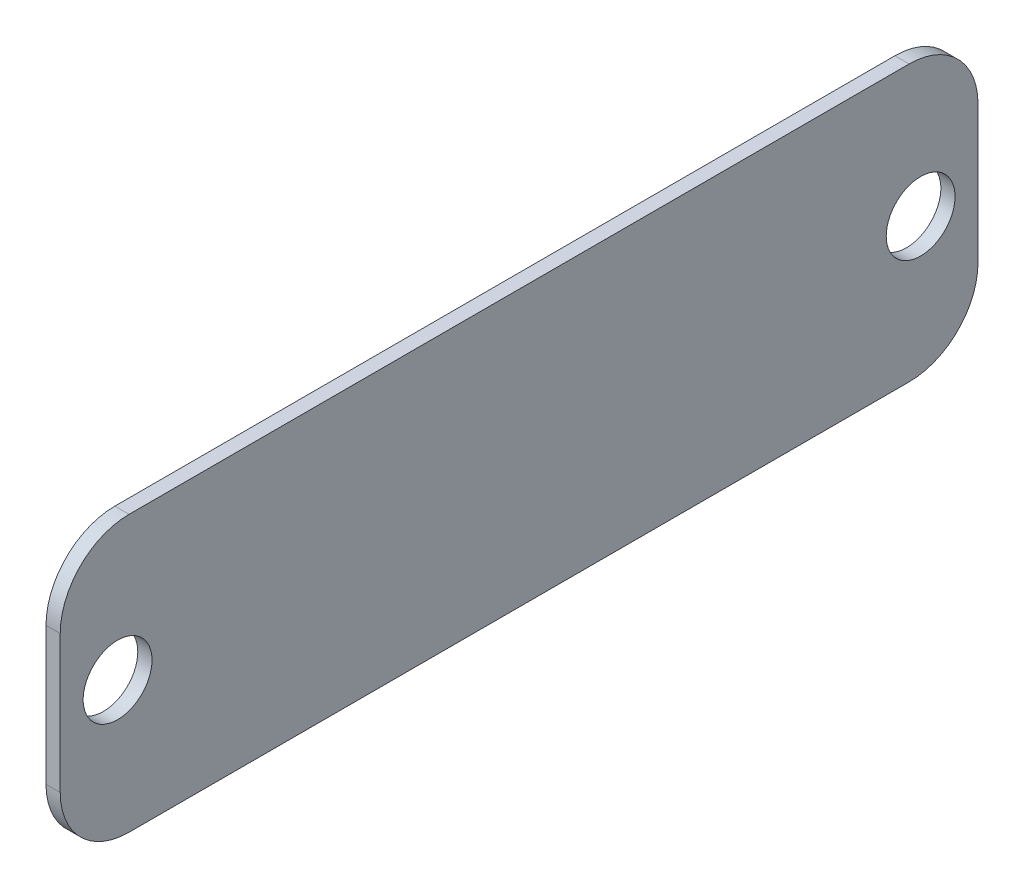
ISO-10303-21;
HEADER;
FILE_DESCRIPTION(('STEP AP214'),'2;1');
FILE_NAME('part.step','',(''),(''),'','','');
FILE_SCHEMA(('AUTOMOTIVE_DESIGN { 1 0 10303 214 1 1 1 1 }'));
ENDSEC;
DATA;
#1=APPLICATION_CONTEXT('core data for automotive mechanical design processes');
#2=APPLICATION_PROTOCOL_DEFINITION('international standard','automotive_design',2000,#1);
#3=PRODUCT_CONTEXT('',#1,'mechanical');
#4=PRODUCT('Part','Part','',(#3));
#5=PRODUCT_RELATED_PRODUCT_CATEGORY('part','',(#4));
#6=PRODUCT_DEFINITION_FORMATION('','',#4);
#7=PRODUCT_DEFINITION_CONTEXT('part definition',#1,'design');
#8=PRODUCT_DEFINITION('design','',#6,#7);
#9=PRODUCT_DEFINITION_SHAPE('','',#8);
#10=(LENGTH_UNIT() NAMED_UNIT(*) SI_UNIT(.MILLI.,.METRE.));
#11=(NAMED_UNIT(*) PLANE_ANGLE_UNIT() SI_UNIT($,.RADIAN.));
#12=(NAMED_UNIT(*) SI_UNIT($,.STERADIAN.) SOLID_ANGLE_UNIT());
#13=UNCERTAINTY_MEASURE_WITH_UNIT(LENGTH_MEASURE(1.E-05),#10,'distance_accuracy_value','');
#14=(GEOMETRIC_REPRESENTATION_CONTEXT(3) GLOBAL_UNCERTAINTY_ASSIGNED_CONTEXT((#13)) GLOBAL_UNIT_ASSIGNED_CONTEXT((#10,
#11,#12)) REPRESENTATION_CONTEXT('',''));
#15=CARTESIAN_POINT('',(0.,0.,0.));
#16=DIRECTION('',(0.,0.,1.));
#17=DIRECTION('',(1.,0.,0.));
#18=AXIS2_PLACEMENT_3D('',#15,#16,#17);
#19=CARTESIAN_POINT('',(1.55,-30.,-100.));
#20=DIRECTION('',(0.,0.,1.));
#21=DIRECTION('',(1.,0.,0.));
#22=AXIS2_PLACEMENT_3D('',#19,#20,#21);
#23=PLANE('',#22);
#24=DIRECTION('',(0.,1.,0.));
#25=VECTOR('',#24,1.);
#26=CARTESIAN_POINT('',(1.55,-30.,-100.));
#27=LINE('',#26,#25);
#28=CARTESIAN_POINT('',(1.55,-15.,-100.));
#29=VERTEX_POINT('',#28);
#30=CARTESIAN_POINT('',(1.55,15.,-100.));
#31=VERTEX_POINT('',#30);
#32=EDGE_CURVE('E117',#29,#31,#27,.T.);
#33=ORIENTED_EDGE('',*,*,#32,.F.);
#34=DIRECTION('',(-1.,0.,0.));
#35=VECTOR('',#34,1.);
#36=CARTESIAN_POINT('',(1.55,-15.,-100.));
#37=LINE('',#36,#35);
#38=CARTESIAN_POINT('',(-1.55,-15.,-100.));
#39=VERTEX_POINT('',#38);
#40=EDGE_CURVE('E102',#29,#39,#37,.T.);
#41=ORIENTED_EDGE('',*,*,#40,.T.);
#42=DIRECTION('',(0.,1.,0.));
#43=VECTOR('',#42,1.);
#44=CARTESIAN_POINT('',(-1.55,-30.,-100.));
#45=LINE('',#44,#43);
#46=CARTESIAN_POINT('',(-1.55,15.,-100.));
#47=VERTEX_POINT('',#46);
#48=EDGE_CURVE('E114',#39,#47,#45,.T.);
#49=ORIENTED_EDGE('',*,*,#48,.T.);
#50=DIRECTION('',(-1.,0.,0.));
#51=VECTOR('',#50,1.);
#52=CARTESIAN_POINT('',(1.55,15.,-100.));
#53=LINE('',#52,#51);
#54=EDGE_CURVE('E119',#47,#31,#53,.F.);
#55=ORIENTED_EDGE('',*,*,#54,.T.);
#56=EDGE_LOOP('',(#33,#41,#49,#55));
#57=FACE_BOUND('',#56,.T.);
#58=ADVANCED_FACE('F33',(#57),#23,.F.);
#59=CARTESIAN_POINT('',(1.55,30.,100.));
#60=DIRECTION('',(0.,-1.,0.));
#61=DIRECTION('',(0.,0.,-1.));
#62=AXIS2_PLACEMENT_3D('',#59,#60,#61);
#63=PLANE('',#62);
#64=DIRECTION('',(0.,0.,1.));
#65=VECTOR('',#64,1.);
#66=CARTESIAN_POINT('',(1.55,30.,100.));
#67=LINE('',#66,#65);
#68=CARTESIAN_POINT('',(1.55,30.,-85.));
#69=VERTEX_POINT('',#68);
#70=CARTESIAN_POINT('',(1.55,30.,85.));
#71=VERTEX_POINT('',#70);
#72=EDGE_CURVE('E172',#69,#71,#67,.T.);
#73=ORIENTED_EDGE('',*,*,#72,.F.);
#74=DIRECTION('',(-1.,0.,0.));
#75=VECTOR('',#74,1.);
#76=CARTESIAN_POINT('',(1.55,30.,-85.));
#77=LINE('',#76,#75);
#78=CARTESIAN_POINT('',(-1.55,30.,-85.));
#79=VERTEX_POINT('',#78);
#80=EDGE_CURVE('E156',#69,#79,#77,.T.);
#81=ORIENTED_EDGE('',*,*,#80,.T.);
#82=DIRECTION('',(0.,0.,1.));
#83=VECTOR('',#82,1.);
#84=CARTESIAN_POINT('',(-1.55,30.,100.));
#85=LINE('',#84,#83);
#86=CARTESIAN_POINT('',(-1.55,30.,85.));
#87=VERTEX_POINT('',#86);
#88=EDGE_CURVE('E123',#79,#87,#85,.T.);
#89=ORIENTED_EDGE('',*,*,#88,.T.);
#90=DIRECTION('',(-1.,0.,0.));
#91=VECTOR('',#90,1.);
#92=CARTESIAN_POINT('',(1.55,30.,85.));
#93=LINE('',#92,#91);
#94=EDGE_CURVE('E154',#87,#71,#93,.F.);
#95=ORIENTED_EDGE('',*,*,#94,.T.);
#96=EDGE_LOOP('',(#73,#81,#89,#95));
#97=FACE_BOUND('',#96,.T.);
#98=ADVANCED_FACE('F210',(#97),#63,.F.);
#99=CARTESIAN_POINT('',(1.55,-30.,100.));
#100=DIRECTION('',(0.,0.,-1.));
#101=DIRECTION('',(-1.,0.,0.));
#102=AXIS2_PLACEMENT_3D('',#99,#100,#101);
#103=PLANE('',#102);
#104=DIRECTION('',(0.,-1.,0.));
#105=VECTOR('',#104,1.);
#106=CARTESIAN_POINT('',(-1.55,-30.,100.));
#107=LINE('',#106,#105);
#108=CARTESIAN_POINT('',(-1.55,15.,100.));
#109=VERTEX_POINT('',#108);
#110=CARTESIAN_POINT('',(-1.55,-15.,100.));
#111=VERTEX_POINT('',#110);
#112=EDGE_CURVE('E127',#109,#111,#107,.T.);
#113=ORIENTED_EDGE('',*,*,#112,.T.);
#114=DIRECTION('',(-1.,0.,0.));
#115=VECTOR('',#114,1.);
#116=CARTESIAN_POINT('',(1.55,-15.,100.));
#117=LINE('',#116,#115);
#118=CARTESIAN_POINT('',(1.55,-15.,100.));
#119=VERTEX_POINT('',#118);
#120=EDGE_CURVE('E11',#111,#119,#117,.F.);
#121=ORIENTED_EDGE('',*,*,#120,.T.);
#122=DIRECTION('',(0.,-1.,0.));
#123=VECTOR('',#122,1.);
#124=CARTESIAN_POINT('',(1.55,-30.,100.));
#125=LINE('',#124,#123);
#126=CARTESIAN_POINT('',(1.55,15.,100.));
#127=VERTEX_POINT('',#126);
#128=EDGE_CURVE('E162',#127,#119,#125,.T.);
#129=ORIENTED_EDGE('',*,*,#128,.F.);
#130=DIRECTION('',(-1.,0.,0.));
#131=VECTOR('',#130,1.);
#132=CARTESIAN_POINT('',(1.55,15.,100.));
#133=LINE('',#132,#131);
#134=EDGE_CURVE('E41',#127,#109,#133,.T.);
#135=ORIENTED_EDGE('',*,*,#134,.T.);
#136=EDGE_LOOP('',(#113,#121,#129,#135));
#137=FACE_BOUND('',#136,.T.);
#138=ADVANCED_FACE('F161',(#137),#103,.F.);
#139=CARTESIAN_POINT('',(1.55,-30.,100.));
#140=DIRECTION('',(0.,1.,0.));
#141=DIRECTION('',(0.,0.,1.));
#142=AXIS2_PLACEMENT_3D('',#139,#140,#141);
#143=PLANE('',#142);
#144=DIRECTION('',(0.,0.,-1.));
#145=VECTOR('',#144,1.);
#146=CARTESIAN_POINT('',(-1.55,-30.,100.));
#147=LINE('',#146,#145);
#148=CARTESIAN_POINT('',(-1.55,-30.,85.));
#149=VERTEX_POINT('',#148);
#150=CARTESIAN_POINT('',(-1.55,-30.,-85.));
#151=VERTEX_POINT('',#150);
#152=EDGE_CURVE('E137',#149,#151,#147,.T.);
#153=ORIENTED_EDGE('',*,*,#152,.T.);
#154=DIRECTION('',(-1.,0.,0.));
#155=VECTOR('',#154,1.);
#156=CARTESIAN_POINT('',(1.55,-30.,-85.));
#157=LINE('',#156,#155);
#158=CARTESIAN_POINT('',(1.55,-30.,-85.));
#159=VERTEX_POINT('',#158);
#160=EDGE_CURVE('E103',#151,#159,#157,.F.);
#161=ORIENTED_EDGE('',*,*,#160,.T.);
#162=DIRECTION('',(0.,0.,-1.));
#163=VECTOR('',#162,1.);
#164=CARTESIAN_POINT('',(1.55,-30.,100.));
#165=LINE('',#164,#163);
#166=CARTESIAN_POINT('',(1.55,-30.,85.));
#167=VERTEX_POINT('',#166);
#168=EDGE_CURVE('E133',#167,#159,#165,.T.);
#169=ORIENTED_EDGE('',*,*,#168,.F.);
#170=DIRECTION('',(-1.,0.,0.));
#171=VECTOR('',#170,1.);
#172=CARTESIAN_POINT('',(1.55,-30.,85.));
#173=LINE('',#172,#171);
#174=EDGE_CURVE('E108',#167,#149,#173,.T.);
#175=ORIENTED_EDGE('',*,*,#174,.T.);
#176=EDGE_LOOP('',(#153,#161,#169,#175));
#177=FACE_BOUND('',#176,.T.);
#178=ADVANCED_FACE('F170',(#177),#143,.F.);
#179=CARTESIAN_POINT('',(1.55,0.,0.));
#180=DIRECTION('',(-1.,0.,0.));
#181=DIRECTION('',(0.,0.,1.));
#182=AXIS2_PLACEMENT_3D('',#179,#180,#181);
#183=PLANE('',#182);
#184=CARTESIAN_POINT('',(1.55,0.,87.5));
#185=DIRECTION('',(1.,0.,0.));
#186=DIRECTION('',(0.,0.,-1.));
#187=AXIS2_PLACEMENT_3D('',#184,#185,#186);
#188=CIRCLE('',#187,7.50000000000001);
#189=CARTESIAN_POINT('',(1.55,0.,80.));
#190=VERTEX_POINT('',#189);
#191=EDGE_CURVE('E130',#190,#190,#188,.T.);
#192=ORIENTED_EDGE('',*,*,#191,.F.);
#193=EDGE_LOOP('',(#192));
#194=FACE_BOUND('',#193,.T.);
#195=CARTESIAN_POINT('',(1.55,0.,-87.5));
#196=DIRECTION('',(1.,0.,0.));
#197=DIRECTION('',(0.,0.,1.));
#198=AXIS2_PLACEMENT_3D('',#195,#196,#197);
#199=CIRCLE('',#198,7.50000000000001);
#200=CARTESIAN_POINT('',(1.55,0.,-80.));
#201=VERTEX_POINT('',#200);
#202=EDGE_CURVE('E179',#201,#201,#199,.T.);
#203=ORIENTED_EDGE('',*,*,#202,.F.);
#204=EDGE_LOOP('',(#203));
#205=FACE_BOUND('',#204,.T.);
#206=ORIENTED_EDGE('',*,*,#168,.T.);
#207=CARTESIAN_POINT('',(1.55,-15.,-85.));
#208=DIRECTION('',(-1.,0.,0.));
#209=DIRECTION('',(0.,0.,1.));
#210=AXIS2_PLACEMENT_3D('',#207,#208,#209);
#211=CIRCLE('',#210,15.);
#212=EDGE_CURVE('E152',#159,#29,#211,.F.);
#213=ORIENTED_EDGE('',*,*,#212,.T.);
#214=ORIENTED_EDGE('',*,*,#32,.T.);
#215=CARTESIAN_POINT('',(1.55,15.,-85.));
#216=DIRECTION('',(-1.,0.,0.));
#217=DIRECTION('',(0.,0.,1.));
#218=AXIS2_PLACEMENT_3D('',#215,#216,#217);
#219=CIRCLE('',#218,15.);
#220=EDGE_CURVE('E150',#31,#69,#219,.F.);
#221=ORIENTED_EDGE('',*,*,#220,.T.);
#222=ORIENTED_EDGE('',*,*,#72,.T.);
#223=CARTESIAN_POINT('',(1.55,15.,85.));
#224=DIRECTION('',(-1.,0.,0.));
#225=DIRECTION('',(0.,0.,1.));
#226=AXIS2_PLACEMENT_3D('',#223,#224,#225);
#227=CIRCLE('',#226,15.);
#228=EDGE_CURVE('E53',#71,#127,#227,.F.);
#229=ORIENTED_EDGE('',*,*,#228,.T.);
#230=ORIENTED_EDGE('',*,*,#128,.T.);
#231=CARTESIAN_POINT('',(1.55,-15.,85.));
#232=DIRECTION('',(-1.,0.,0.));
#233=DIRECTION('',(0.,0.,1.));
#234=AXIS2_PLACEMENT_3D('',#231,#232,#233);
#235=CIRCLE('',#234,15.);
#236=EDGE_CURVE('E148',#119,#167,#235,.F.);
#237=ORIENTED_EDGE('',*,*,#236,.T.);
#238=EDGE_LOOP('',(#206,#213,#214,#221,#222,#229,#230,#237));
#239=FACE_BOUND('',#238,.T.);
#240=ADVANCED_FACE('F188',(#194,#205,#239),#183,.F.);
#241=CARTESIAN_POINT('',(-1.55,0.,0.));
#242=DIRECTION('',(-1.,0.,0.));
#243=DIRECTION('',(0.,0.,1.));
#244=AXIS2_PLACEMENT_3D('',#241,#242,#243);
#245=PLANE('',#244);
#246=CARTESIAN_POINT('',(-1.55,0.,87.5));
#247=DIRECTION('',(-1.,0.,0.));
#248=DIRECTION('',(0.,0.,1.));
#249=AXIS2_PLACEMENT_3D('',#246,#247,#248);
#250=CIRCLE('',#249,7.50000000000001);
#251=CARTESIAN_POINT('',(-1.55,0.,95.));
#252=VERTEX_POINT('',#251);
#253=EDGE_CURVE('E124',#252,#252,#250,.F.);
#254=ORIENTED_EDGE('',*,*,#253,.T.);
#255=EDGE_LOOP('',(#254));
#256=FACE_BOUND('',#255,.T.);
#257=CARTESIAN_POINT('',(-1.55,0.,-87.5));
#258=DIRECTION('',(-1.,0.,0.));
#259=DIRECTION('',(0.,0.,1.));
#260=AXIS2_PLACEMENT_3D('',#257,#258,#259);
#261=CIRCLE('',#260,7.50000000000001);
#262=CARTESIAN_POINT('',(-1.55,0.,-80.));
#263=VERTEX_POINT('',#262);
#264=EDGE_CURVE('E176',#263,#263,#261,.F.);
#265=ORIENTED_EDGE('',*,*,#264,.T.);
#266=EDGE_LOOP('',(#265));
#267=FACE_BOUND('',#266,.T.);
#268=ORIENTED_EDGE('',*,*,#48,.F.);
#269=CARTESIAN_POINT('',(-1.55,-15.,-85.));
#270=DIRECTION('',(-1.,0.,0.));
#271=DIRECTION('',(0.,0.,1.));
#272=AXIS2_PLACEMENT_3D('',#269,#270,#271);
#273=CIRCLE('',#272,15.);
#274=EDGE_CURVE('E98',#39,#151,#273,.T.);
#275=ORIENTED_EDGE('',*,*,#274,.T.);
#276=ORIENTED_EDGE('',*,*,#152,.F.);
#277=CARTESIAN_POINT('',(-1.55,-15.,85.));
#278=DIRECTION('',(-1.,0.,0.));
#279=DIRECTION('',(0.,0.,1.));
#280=AXIS2_PLACEMENT_3D('',#277,#278,#279);
#281=CIRCLE('',#280,15.);
#282=EDGE_CURVE('E141',#149,#111,#281,.T.);
#283=ORIENTED_EDGE('',*,*,#282,.T.);
#284=ORIENTED_EDGE('',*,*,#112,.F.);
#285=CARTESIAN_POINT('',(-1.55,15.,85.));
#286=DIRECTION('',(-1.,0.,0.));
#287=DIRECTION('',(0.,0.,1.));
#288=AXIS2_PLACEMENT_3D('',#285,#286,#287);
#289=CIRCLE('',#288,15.);
#290=EDGE_CURVE('E118',#109,#87,#289,.T.);
#291=ORIENTED_EDGE('',*,*,#290,.T.);
#292=ORIENTED_EDGE('',*,*,#88,.F.);
#293=CARTESIAN_POINT('',(-1.55,15.,-85.));
#294=DIRECTION('',(-1.,0.,0.));
#295=DIRECTION('',(0.,0.,1.));
#296=AXIS2_PLACEMENT_3D('',#293,#294,#295);
#297=CIRCLE('',#296,15.);
#298=EDGE_CURVE('E109',#79,#47,#297,.T.);
#299=ORIENTED_EDGE('',*,*,#298,.T.);
#300=EDGE_LOOP('',(#268,#275,#276,#283,#284,#291,#292,#299));
#301=FACE_BOUND('',#300,.T.);
#302=ADVANCED_FACE('F121',(#256,#267,#301),#245,.T.);
#303=CARTESIAN_POINT('',(1.55,-15.,-85.));
#304=DIRECTION('',(-1.,0.,0.));
#305=DIRECTION('',(0.,0.,1.));
#306=AXIS2_PLACEMENT_3D('',#303,#304,#305);
#307=CYLINDRICAL_SURFACE('',#306,15.);
#308=ORIENTED_EDGE('',*,*,#212,.F.);
#309=ORIENTED_EDGE('',*,*,#160,.F.);
#310=ORIENTED_EDGE('',*,*,#274,.F.);
#311=ORIENTED_EDGE('',*,*,#40,.F.);
#312=EDGE_LOOP('',(#308,#309,#310,#311));
#313=FACE_BOUND('',#312,.T.);
#314=ADVANCED_FACE('F101',(#313),#307,.T.);
#315=CARTESIAN_POINT('',(1.55,15.,-85.));
#316=DIRECTION('',(-1.,0.,0.));
#317=DIRECTION('',(0.,0.,1.));
#318=AXIS2_PLACEMENT_3D('',#315,#316,#317);
#319=CYLINDRICAL_SURFACE('',#318,15.);
#320=ORIENTED_EDGE('',*,*,#220,.F.);
#321=ORIENTED_EDGE('',*,*,#54,.F.);
#322=ORIENTED_EDGE('',*,*,#298,.F.);
#323=ORIENTED_EDGE('',*,*,#80,.F.);
#324=EDGE_LOOP('',(#320,#321,#322,#323));
#325=FACE_BOUND('',#324,.T.);
#326=ADVANCED_FACE('F206',(#325),#319,.T.);
#327=CARTESIAN_POINT('',(1.55,-15.,85.));
#328=DIRECTION('',(-1.,0.,0.));
#329=DIRECTION('',(0.,0.,1.));
#330=AXIS2_PLACEMENT_3D('',#327,#328,#329);
#331=CYLINDRICAL_SURFACE('',#330,15.);
#332=ORIENTED_EDGE('',*,*,#236,.F.);
#333=ORIENTED_EDGE('',*,*,#120,.F.);
#334=ORIENTED_EDGE('',*,*,#282,.F.);
#335=ORIENTED_EDGE('',*,*,#174,.F.);
#336=EDGE_LOOP('',(#332,#333,#334,#335));
#337=FACE_BOUND('',#336,.T.);
#338=ADVANCED_FACE('F167',(#337),#331,.T.);
#339=CARTESIAN_POINT('',(1.55,15.,85.));
#340=DIRECTION('',(-1.,0.,0.));
#341=DIRECTION('',(0.,0.,1.));
#342=AXIS2_PLACEMENT_3D('',#339,#340,#341);
#343=CYLINDRICAL_SURFACE('',#342,15.);
#344=ORIENTED_EDGE('',*,*,#228,.F.);
#345=ORIENTED_EDGE('',*,*,#94,.F.);
#346=ORIENTED_EDGE('',*,*,#290,.F.);
#347=ORIENTED_EDGE('',*,*,#134,.F.);
#348=EDGE_LOOP('',(#344,#345,#346,#347));
#349=FACE_BOUND('',#348,.T.);
#350=ADVANCED_FACE('F35',(#349),#343,.T.);
#351=CARTESIAN_POINT('',(-22.7632034355965,0.,-87.5));
#352=DIRECTION('',(1.,0.,0.));
#353=DIRECTION('',(0.,0.,-1.));
#354=AXIS2_PLACEMENT_3D('',#351,#352,#353);
#355=CYLINDRICAL_SURFACE('',#354,7.50000000000001);
#356=ORIENTED_EDGE('',*,*,#202,.T.);
#357=EDGE_LOOP('',(#356));
#358=FACE_BOUND('',#357,.T.);
#359=ORIENTED_EDGE('',*,*,#264,.F.);
#360=EDGE_LOOP('',(#359));
#361=FACE_BOUND('',#360,.T.);
#362=ADVANCED_FACE('F194',(#358,#361),#355,.F.);
#363=CARTESIAN_POINT('',(-22.7632034355965,0.,87.5));
#364=DIRECTION('',(1.,0.,0.));
#365=DIRECTION('',(0.,0.,-1.));
#366=AXIS2_PLACEMENT_3D('',#363,#364,#365);
#367=CYLINDRICAL_SURFACE('',#366,7.50000000000001);
#368=ORIENTED_EDGE('',*,*,#191,.T.);
#369=EDGE_LOOP('',(#368));
#370=FACE_BOUND('',#369,.T.);
#371=ORIENTED_EDGE('',*,*,#253,.F.);
#372=EDGE_LOOP('',(#371));
#373=FACE_BOUND('',#372,.T.);
#374=ADVANCED_FACE('F185',(#370,#373),#367,.F.);
#375=CLOSED_SHELL('',(#58,#98,#138,#178,#240,#302,#314,#326,#338,#350,#362,#374));
#376=MANIFOLD_SOLID_BREP('B2',#375);
#377=ADVANCED_BREP_SHAPE_REPRESENTATION('',(#18,#376),#14);
#378=SHAPE_DEFINITION_REPRESENTATION(#9,#377);
ENDSEC;
END-ISO-10303-21;
